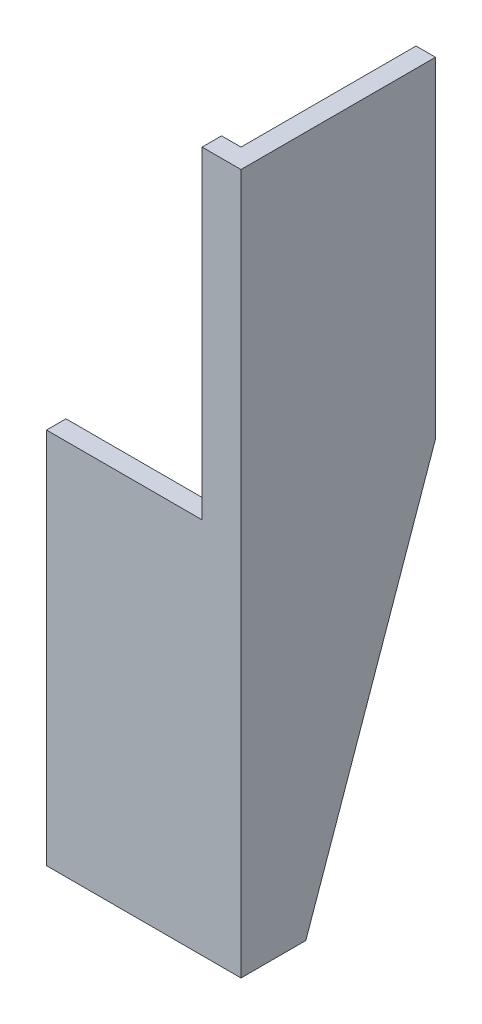
ISO-10303-21;
HEADER;
FILE_DESCRIPTION(('STEP AP214'),'2;1');
FILE_NAME('part.step','',(''),(''),'','','');
FILE_SCHEMA(('AUTOMOTIVE_DESIGN { 1 0 10303 214 1 1 1 1 }'));
ENDSEC;
DATA;
#1=APPLICATION_CONTEXT('core data for automotive mechanical design processes');
#2=APPLICATION_PROTOCOL_DEFINITION('international standard','automotive_design',2000,#1);
#3=PRODUCT_CONTEXT('',#1,'mechanical');
#4=PRODUCT('Part','Part','',(#3));
#5=PRODUCT_RELATED_PRODUCT_CATEGORY('part','',(#4));
#6=PRODUCT_DEFINITION_FORMATION('','',#4);
#7=PRODUCT_DEFINITION_CONTEXT('part definition',#1,'design');
#8=PRODUCT_DEFINITION('design','',#6,#7);
#9=PRODUCT_DEFINITION_SHAPE('','',#8);
#10=(LENGTH_UNIT() NAMED_UNIT(*) SI_UNIT(.MILLI.,.METRE.));
#11=(NAMED_UNIT(*) PLANE_ANGLE_UNIT() SI_UNIT($,.RADIAN.));
#12=(NAMED_UNIT(*) SI_UNIT($,.STERADIAN.) SOLID_ANGLE_UNIT());
#13=UNCERTAINTY_MEASURE_WITH_UNIT(LENGTH_MEASURE(1.E-05),#10,'distance_accuracy_value','');
#14=(GEOMETRIC_REPRESENTATION_CONTEXT(3) GLOBAL_UNCERTAINTY_ASSIGNED_CONTEXT((#13)) GLOBAL_UNIT_ASSIGNED_CONTEXT((#10,
#11,#12)) REPRESENTATION_CONTEXT('',''));
#15=CARTESIAN_POINT('',(0.,0.,0.));
#16=DIRECTION('',(0.,0.,1.));
#17=DIRECTION('',(1.,0.,0.));
#18=AXIS2_PLACEMENT_3D('',#15,#16,#17);
#19=CARTESIAN_POINT('',(1.66533453693773E-13,180.,1.11022302462516E-13));
#20=DIRECTION('',(-0.999999999999998,0.,0.));
#21=DIRECTION('',(0.,0.,1.));
#22=AXIS2_PLACEMENT_3D('',#19,#20,#21);
#23=PLANE('',#22);
#24=DIRECTION('',(0.,0.,-1.));
#25=VECTOR('',#24,1.);
#26=CARTESIAN_POINT('',(0.,0.,0.));
#27=LINE('',#26,#25);
#28=CARTESIAN_POINT('',(0.,0.,0.));
#29=VERTEX_POINT('',#28);
#30=CARTESIAN_POINT('',(1.66533453693773E-13,-1.11022302462516E-13,-16.6666666666667));
#31=VERTEX_POINT('',#30);
#32=EDGE_CURVE('E164',#29,#31,#27,.T.);
#33=ORIENTED_EDGE('',*,*,#32,.T.);
#34=DIRECTION('',(0.,-0.943599982132881,0.331087713029081));
#35=VECTOR('',#34,1.);
#36=CARTESIAN_POINT('',(2.77555756156289E-13,95.,-50.));
#37=LINE('',#36,#35);
#38=CARTESIAN_POINT('',(2.77555756156289E-13,95.,-50.));
#39=VERTEX_POINT('',#38);
#40=EDGE_CURVE('E60',#39,#31,#37,.T.);
#41=ORIENTED_EDGE('',*,*,#40,.F.);
#42=DIRECTION('',(0.,-1.,0.));
#43=VECTOR('',#42,1.);
#44=CARTESIAN_POINT('',(4.9960036108132E-13,180.,-49.9999999999993));
#45=LINE('',#44,#43);
#46=CARTESIAN_POINT('',(4.9960036108132E-13,180.,-49.9999999999993));
#47=VERTEX_POINT('',#46);
#48=EDGE_CURVE('E11',#47,#39,#45,.T.);
#49=ORIENTED_EDGE('',*,*,#48,.F.);
#50=DIRECTION('',(0.,0.,-1.));
#51=VECTOR('',#50,1.);
#52=CARTESIAN_POINT('',(1.66533453693773E-13,180.,1.11022302462516E-13));
#53=LINE('',#52,#51);
#54=CARTESIAN_POINT('',(1.66533453693773E-13,180.,1.11022302462516E-13));
#55=VERTEX_POINT('',#54);
#56=EDGE_CURVE('E165',#55,#47,#53,.T.);
#57=ORIENTED_EDGE('',*,*,#56,.F.);
#58=DIRECTION('',(0.,-1.,0.));
#59=VECTOR('',#58,1.);
#60=CARTESIAN_POINT('',(1.66533453693773E-13,180.,1.11022302462516E-13));
#61=LINE('',#60,#59);
#62=EDGE_CURVE('E131',#55,#29,#61,.T.);
#63=ORIENTED_EDGE('',*,*,#62,.T.);
#64=EDGE_LOOP('',(#33,#41,#49,#57,#63));
#65=FACE_BOUND('',#64,.T.);
#66=ADVANCED_FACE('F38',(#65),#23,.F.);
#67=CARTESIAN_POINT('',(-5.00000000000017,180.,-49.9999999999996));
#68=DIRECTION('',(0.,0.,1.));
#69=DIRECTION('',(0.999999999999998,0.,0.));
#70=AXIS2_PLACEMENT_3D('',#67,#68,#69);
#71=PLANE('',#70);
#72=ORIENTED_EDGE('',*,*,#48,.T.);
#73=DIRECTION('',(0.999999999999998,0.,0.));
#74=VECTOR('',#73,1.);
#75=CARTESIAN_POINT('',(-105.678255403593,94.9999999999987,-49.9999999999985));
#76=LINE('',#75,#74);
#77=CARTESIAN_POINT('',(-5.00000000000017,94.9999999999997,-50.));
#78=VERTEX_POINT('',#77);
#79=EDGE_CURVE('E156',#78,#39,#76,.T.);
#80=ORIENTED_EDGE('',*,*,#79,.F.);
#81=DIRECTION('',(0.,-1.,0.));
#82=VECTOR('',#81,1.);
#83=CARTESIAN_POINT('',(-5.00000000000017,180.,-49.9999999999996));
#84=LINE('',#83,#82);
#85=CARTESIAN_POINT('',(-5.00000000000017,180.,-49.9999999999996));
#86=VERTEX_POINT('',#85);
#87=EDGE_CURVE('E45',#86,#78,#84,.T.);
#88=ORIENTED_EDGE('',*,*,#87,.F.);
#89=DIRECTION('',(-0.999999999999998,0.,0.));
#90=VECTOR('',#89,1.);
#91=CARTESIAN_POINT('',(-5.00000000000017,180.,-49.9999999999996));
#92=LINE('',#91,#90);
#93=EDGE_CURVE('E154',#47,#86,#92,.T.);
#94=ORIENTED_EDGE('',*,*,#93,.F.);
#95=EDGE_LOOP('',(#72,#80,#88,#94));
#96=FACE_BOUND('',#95,.T.);
#97=ADVANCED_FACE('F153',(#96),#71,.F.);
#98=CARTESIAN_POINT('',(-4.9999999999995,179.999999999999,-4.99999999999806));
#99=DIRECTION('',(0.999999999999998,0.,0.));
#100=DIRECTION('',(0.,0.,-1.));
#101=AXIS2_PLACEMENT_3D('',#98,#99,#100);
#102=PLANE('',#101);
#103=ORIENTED_EDGE('',*,*,#87,.T.);
#104=DIRECTION('',(0.,0.943599982132881,-0.331087713029081));
#105=VECTOR('',#104,1.);
#106=CARTESIAN_POINT('',(-5.00000000000017,94.9999999999997,-50.));
#107=LINE('',#106,#105);
#108=CARTESIAN_POINT('',(-4.99999999999995,-5.55111512312578E-13,-16.6666666666662));
#109=VERTEX_POINT('',#108);
#110=EDGE_CURVE('E147',#109,#78,#107,.T.);
#111=ORIENTED_EDGE('',*,*,#110,.F.);
#112=DIRECTION('',(0.,0.,1.));
#113=VECTOR('',#112,1.);
#114=CARTESIAN_POINT('',(-4.99999999999973,-1.66533453693773E-13,-5.00000000000017));
#115=LINE('',#114,#113);
#116=CARTESIAN_POINT('',(-4.99999999999973,-1.66533453693773E-13,-5.00000000000017));
#117=VERTEX_POINT('',#116);
#118=EDGE_CURVE('E176',#109,#117,#115,.T.);
#119=ORIENTED_EDGE('',*,*,#118,.T.);
#120=DIRECTION('',(0.,-1.,0.));
#121=VECTOR('',#120,1.);
#122=CARTESIAN_POINT('',(-4.9999999999995,179.999999999999,-4.99999999999806));
#123=LINE('',#122,#121);
#124=CARTESIAN_POINT('',(-4.9999999999995,179.999999999999,-4.99999999999806));
#125=VERTEX_POINT('',#124);
#126=EDGE_CURVE('E133',#125,#117,#123,.T.);
#127=ORIENTED_EDGE('',*,*,#126,.F.);
#128=DIRECTION('',(0.,0.,1.));
#129=VECTOR('',#128,1.);
#130=CARTESIAN_POINT('',(-4.9999999999995,179.999999999999,-4.99999999999806));
#131=LINE('',#130,#129);
#132=EDGE_CURVE('E150',#86,#125,#131,.T.);
#133=ORIENTED_EDGE('',*,*,#132,.F.);
#134=EDGE_LOOP('',(#103,#111,#119,#127,#133));
#135=FACE_BOUND('',#134,.T.);
#136=ADVANCED_FACE('F146',(#135),#102,.F.);
#137=CARTESIAN_POINT('',(-4.9999999999995,179.999999999999,-4.99999999999806));
#138=DIRECTION('',(0.,0.,1.));
#139=DIRECTION('',(0.999999999999999,0.,0.));
#140=AXIS2_PLACEMENT_3D('',#137,#138,#139);
#141=PLANE('',#140);
#142=DIRECTION('',(-0.999999999999999,0.,0.));
#143=VECTOR('',#142,1.);
#144=CARTESIAN_POINT('',(-49.9999999999998,96.9999999999999,-5.00000000000017));
#145=LINE('',#144,#143);
#146=CARTESIAN_POINT('',(-10.,96.9999999999994,-4.99999999999967));
#147=VERTEX_POINT('',#146);
#148=CARTESIAN_POINT('',(-49.9999999999998,96.9999999999999,-5.00000000000017));
#149=VERTEX_POINT('',#148);
#150=EDGE_CURVE('E114',#147,#149,#145,.T.);
#151=ORIENTED_EDGE('',*,*,#150,.F.);
#152=DIRECTION('',(0.,-1.,0.));
#153=VECTOR('',#152,1.);
#154=CARTESIAN_POINT('',(-9.9999999999999,180.,-4.99999999999995));
#155=LINE('',#154,#153);
#156=CARTESIAN_POINT('',(-9.9999999999999,180.,-4.99999999999995));
#157=VERTEX_POINT('',#156);
#158=EDGE_CURVE('E224',#157,#147,#155,.T.);
#159=ORIENTED_EDGE('',*,*,#158,.F.);
#160=DIRECTION('',(-0.999999999999999,0.,0.));
#161=VECTOR('',#160,1.);
#162=CARTESIAN_POINT('',(-4.9999999999995,179.999999999999,-4.99999999999806));
#163=LINE('',#162,#161);
#164=EDGE_CURVE('E170',#125,#157,#163,.T.);
#165=ORIENTED_EDGE('',*,*,#164,.F.);
#166=ORIENTED_EDGE('',*,*,#126,.T.);
#167=DIRECTION('',(-0.999999999999999,0.,0.));
#168=VECTOR('',#167,1.);
#169=CARTESIAN_POINT('',(-4.99999999999973,-1.66533453693773E-13,-5.00000000000017));
#170=LINE('',#169,#168);
#171=CARTESIAN_POINT('',(-50.0000000000008,-1.94289029309402E-12,-4.99999999999867));
#172=VERTEX_POINT('',#171);
#173=EDGE_CURVE('E178',#117,#172,#170,.T.);
#174=ORIENTED_EDGE('',*,*,#173,.T.);
#175=DIRECTION('',(0.,-1.,0.));
#176=VECTOR('',#175,1.);
#177=CARTESIAN_POINT('',(-49.9999999999999,179.999999999999,-4.99999999999823));
#178=LINE('',#177,#176);
#179=EDGE_CURVE('E130',#149,#172,#178,.T.);
#180=ORIENTED_EDGE('',*,*,#179,.F.);
#181=EDGE_LOOP('',(#151,#159,#165,#166,#174,#180));
#182=FACE_BOUND('',#181,.T.);
#183=ADVANCED_FACE('F208',(#182),#141,.F.);
#184=CARTESIAN_POINT('',(-49.9999999999999,179.999999999999,-4.99999999999823));
#185=DIRECTION('',(0.999999999999998,0.,0.));
#186=DIRECTION('',(0.,0.,-1.));
#187=AXIS2_PLACEMENT_3D('',#184,#185,#186);
#188=PLANE('',#187);
#189=DIRECTION('',(0.,-1.,0.));
#190=VECTOR('',#189,1.);
#191=CARTESIAN_POINT('',(-50.,180.,1.11022302462516E-13));
#192=LINE('',#191,#190);
#193=CARTESIAN_POINT('',(-50.,96.9999999999994,7.7715611723761E-13));
#194=VERTEX_POINT('',#193);
#195=CARTESIAN_POINT('',(-49.9999999999999,-1.11022302462516E-13,0.));
#196=VERTEX_POINT('',#195);
#197=EDGE_CURVE('E123',#194,#196,#192,.T.);
#198=ORIENTED_EDGE('',*,*,#197,.F.);
#199=DIRECTION('',(0.,0.,1.));
#200=VECTOR('',#199,1.);
#201=CARTESIAN_POINT('',(-50.0000000000002,96.9999999999994,-97.1357693840995));
#202=LINE('',#201,#200);
#203=EDGE_CURVE('E108',#149,#194,#202,.T.);
#204=ORIENTED_EDGE('',*,*,#203,.F.);
#205=ORIENTED_EDGE('',*,*,#179,.T.);
#206=DIRECTION('',(0.,0.,1.));
#207=VECTOR('',#206,1.);
#208=CARTESIAN_POINT('',(-50.0000000000008,-1.94289029309402E-12,-4.99999999999867));
#209=LINE('',#208,#207);
#210=EDGE_CURVE('E128',#172,#196,#209,.T.);
#211=ORIENTED_EDGE('',*,*,#210,.T.);
#212=EDGE_LOOP('',(#198,#204,#205,#211));
#213=FACE_BOUND('',#212,.T.);
#214=ADVANCED_FACE('F126',(#213),#188,.F.);
#215=CARTESIAN_POINT('',(1.66533453693773E-13,180.,1.11022302462516E-13));
#216=DIRECTION('',(0.,0.,-1.));
#217=DIRECTION('',(-0.999999999999999,0.,0.));
#218=AXIS2_PLACEMENT_3D('',#215,#216,#217);
#219=PLANE('',#218);
#220=DIRECTION('',(0.999999999999999,0.,0.));
#221=VECTOR('',#220,1.);
#222=CARTESIAN_POINT('',(1.66533453693773E-13,180.,1.11022302462516E-13));
#223=LINE('',#222,#221);
#224=CARTESIAN_POINT('',(-9.99999999999956,179.999999999999,2.05391259555654E-12));
#225=VERTEX_POINT('',#224);
#226=EDGE_CURVE('E136',#225,#55,#223,.T.);
#227=ORIENTED_EDGE('',*,*,#226,.F.);
#228=DIRECTION('',(0.,1.,0.));
#229=VECTOR('',#228,1.);
#230=CARTESIAN_POINT('',(-9.99999999999956,179.999999999999,2.05391259555654E-12));
#231=LINE('',#230,#229);
#232=CARTESIAN_POINT('',(-9.9999999999999,96.9999999999999,0.));
#233=VERTEX_POINT('',#232);
#234=EDGE_CURVE('E52',#233,#225,#231,.T.);
#235=ORIENTED_EDGE('',*,*,#234,.F.);
#236=DIRECTION('',(0.999999999999998,0.,0.));
#237=VECTOR('',#236,1.);
#238=CARTESIAN_POINT('',(-50.,96.9999999999994,7.7715611723761E-13));
#239=LINE('',#238,#237);
#240=EDGE_CURVE('E112',#194,#233,#239,.T.);
#241=ORIENTED_EDGE('',*,*,#240,.F.);
#242=ORIENTED_EDGE('',*,*,#197,.T.);
#243=DIRECTION('',(0.999999999999999,0.,0.));
#244=VECTOR('',#243,1.);
#245=CARTESIAN_POINT('',(0.,0.,0.));
#246=LINE('',#245,#244);
#247=EDGE_CURVE('E167',#196,#29,#246,.T.);
#248=ORIENTED_EDGE('',*,*,#247,.T.);
#249=ORIENTED_EDGE('',*,*,#62,.F.);
#250=EDGE_LOOP('',(#227,#235,#241,#242,#248,#249));
#251=FACE_BOUND('',#250,.T.);
#252=ADVANCED_FACE('F122',(#251),#219,.F.);
#253=CARTESIAN_POINT('',(1.66533453693773E-13,180.,1.11022302462516E-13));
#254=DIRECTION('',(0.,-1.,0.));
#255=DIRECTION('',(0.,0.,-1.));
#256=AXIS2_PLACEMENT_3D('',#253,#254,#255);
#257=PLANE('',#256);
#258=ORIENTED_EDGE('',*,*,#164,.T.);
#259=DIRECTION('',(0.,0.,1.));
#260=VECTOR('',#259,1.);
#261=CARTESIAN_POINT('',(-10.0000000000015,179.999999999999,-97.1357693840986));
#262=LINE('',#261,#260);
#263=EDGE_CURVE('E222',#157,#225,#262,.T.);
#264=ORIENTED_EDGE('',*,*,#263,.T.);
#265=ORIENTED_EDGE('',*,*,#226,.T.);
#266=ORIENTED_EDGE('',*,*,#56,.T.);
#267=ORIENTED_EDGE('',*,*,#93,.T.);
#268=ORIENTED_EDGE('',*,*,#132,.T.);
#269=EDGE_LOOP('',(#258,#264,#265,#266,#267,#268));
#270=FACE_BOUND('',#269,.T.);
#271=ADVANCED_FACE('F197',(#270),#257,.F.);
#272=CARTESIAN_POINT('',(0.,0.,0.));
#273=DIRECTION('',(0.,-1.,0.));
#274=DIRECTION('',(0.,0.,-1.));
#275=AXIS2_PLACEMENT_3D('',#272,#273,#274);
#276=PLANE('',#275);
#277=DIRECTION('',(0.999999999999998,0.,0.));
#278=VECTOR('',#277,1.);
#279=CARTESIAN_POINT('',(-105.678255403592,-2.16493489801906E-12,-16.6666666666652));
#280=LINE('',#279,#278);
#281=EDGE_CURVE('E158',#109,#31,#280,.T.);
#282=ORIENTED_EDGE('',*,*,#281,.T.);
#283=ORIENTED_EDGE('',*,*,#32,.F.);
#284=ORIENTED_EDGE('',*,*,#247,.F.);
#285=ORIENTED_EDGE('',*,*,#210,.F.);
#286=ORIENTED_EDGE('',*,*,#173,.F.);
#287=ORIENTED_EDGE('',*,*,#118,.F.);
#288=EDGE_LOOP('',(#282,#283,#284,#285,#286,#287));
#289=FACE_BOUND('',#288,.T.);
#290=ADVANCED_FACE('F186',(#289),#276,.T.);
#291=CARTESIAN_POINT('',(-105.678255403593,94.9999999999987,-49.9999999999985));
#292=DIRECTION('',(0.,0.331087713029082,0.943599982132881));
#293=DIRECTION('',(0.,-0.943599982132881,0.331087713029081));
#294=AXIS2_PLACEMENT_3D('',#291,#292,#293);
#295=PLANE('',#294);
#296=ORIENTED_EDGE('',*,*,#110,.T.);
#297=ORIENTED_EDGE('',*,*,#79,.T.);
#298=ORIENTED_EDGE('',*,*,#40,.T.);
#299=ORIENTED_EDGE('',*,*,#281,.F.);
#300=EDGE_LOOP('',(#296,#297,#298,#299));
#301=FACE_BOUND('',#300,.T.);
#302=ADVANCED_FACE('F188',(#301),#295,.F.);
#303=CARTESIAN_POINT('',(-10.0000000000015,179.999999999999,-97.1357693840986));
#304=DIRECTION('',(0.999999999999999,0.,0.));
#305=DIRECTION('',(0.,1.,0.));
#306=AXIS2_PLACEMENT_3D('',#303,#304,#305);
#307=PLANE('',#306);
#308=ORIENTED_EDGE('',*,*,#158,.T.);
#309=DIRECTION('',(0.,0.,1.));
#310=VECTOR('',#309,1.);
#311=CARTESIAN_POINT('',(-9.99999999999923,96.9999999999984,-97.1357693840973));
#312=LINE('',#311,#310);
#313=EDGE_CURVE('E118',#147,#233,#312,.T.);
#314=ORIENTED_EDGE('',*,*,#313,.T.);
#315=ORIENTED_EDGE('',*,*,#234,.T.);
#316=ORIENTED_EDGE('',*,*,#263,.F.);
#317=EDGE_LOOP('',(#308,#314,#315,#316));
#318=FACE_BOUND('',#317,.T.);
#319=ADVANCED_FACE('F190',(#318),#307,.F.);
#320=CARTESIAN_POINT('',(-50.0000000000002,96.9999999999994,-97.1357693840995));
#321=DIRECTION('',(0.,-1.,0.));
#322=DIRECTION('',(0.,0.,-1.));
#323=AXIS2_PLACEMENT_3D('',#320,#321,#322);
#324=PLANE('',#323);
#325=ORIENTED_EDGE('',*,*,#150,.T.);
#326=ORIENTED_EDGE('',*,*,#203,.T.);
#327=ORIENTED_EDGE('',*,*,#240,.T.);
#328=ORIENTED_EDGE('',*,*,#313,.F.);
#329=EDGE_LOOP('',(#325,#326,#327,#328));
#330=FACE_BOUND('',#329,.T.);
#331=ADVANCED_FACE('F110',(#330),#324,.F.);
#332=CLOSED_SHELL('',(#66,#97,#136,#183,#214,#252,#271,#290,#302,#319,#331));
#333=MANIFOLD_SOLID_BREP('B2',#332);
#334=ADVANCED_BREP_SHAPE_REPRESENTATION('',(#18,#333),#14);
#335=SHAPE_DEFINITION_REPRESENTATION(#9,#334);
ENDSEC;
END-ISO-10303-21;
